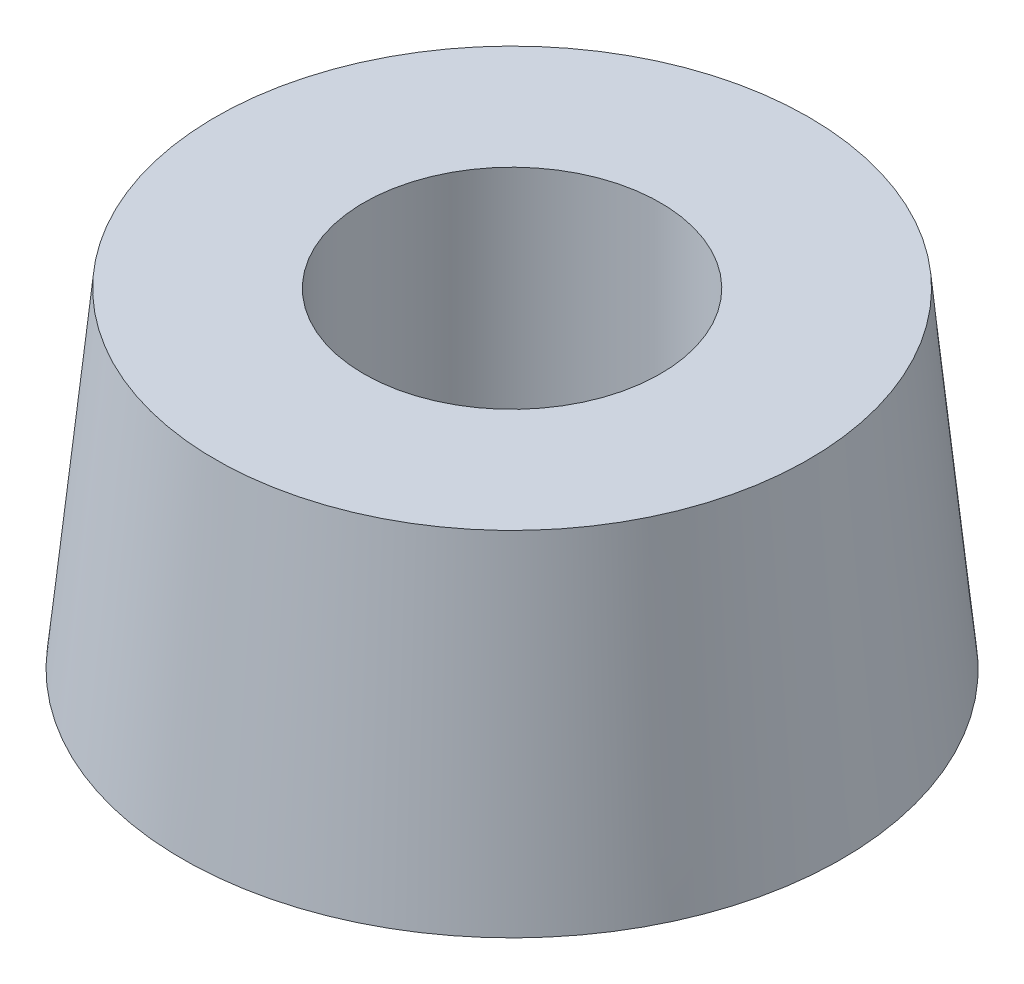
ISO-10303-21;
HEADER;
FILE_DESCRIPTION(('STEP AP214'),'2;1');
FILE_NAME('part.step','',(''),(''),'','','');
FILE_SCHEMA(('AUTOMOTIVE_DESIGN { 1 0 10303 214 1 1 1 1 }'));
ENDSEC;
DATA;
#1=APPLICATION_CONTEXT('core data for automotive mechanical design processes');
#2=APPLICATION_PROTOCOL_DEFINITION('international standard','automotive_design',2000,#1);
#3=PRODUCT_CONTEXT('',#1,'mechanical');
#4=PRODUCT('Part','Part','',(#3));
#5=PRODUCT_RELATED_PRODUCT_CATEGORY('part','',(#4));
#6=PRODUCT_DEFINITION_FORMATION('','',#4);
#7=PRODUCT_DEFINITION_CONTEXT('part definition',#1,'design');
#8=PRODUCT_DEFINITION('design','',#6,#7);
#9=PRODUCT_DEFINITION_SHAPE('','',#8);
#10=(LENGTH_UNIT() NAMED_UNIT(*) SI_UNIT(.MILLI.,.METRE.));
#11=(NAMED_UNIT(*) PLANE_ANGLE_UNIT() SI_UNIT($,.RADIAN.));
#12=(NAMED_UNIT(*) SI_UNIT($,.STERADIAN.) SOLID_ANGLE_UNIT());
#13=UNCERTAINTY_MEASURE_WITH_UNIT(LENGTH_MEASURE(1.E-05),#10,'distance_accuracy_value','');
#14=(GEOMETRIC_REPRESENTATION_CONTEXT(3) GLOBAL_UNCERTAINTY_ASSIGNED_CONTEXT((#13)) GLOBAL_UNIT_ASSIGNED_CONTEXT((#10,
#11,#12)) REPRESENTATION_CONTEXT('',''));
#15=CARTESIAN_POINT('',(0.,0.,0.));
#16=DIRECTION('',(0.,0.,1.));
#17=DIRECTION('',(1.,0.,0.));
#18=AXIS2_PLACEMENT_3D('',#15,#16,#17);
#19=CARTESIAN_POINT('',(0.,10.,0.));
#20=DIRECTION('',(0.,-1.,0.));
#21=DIRECTION('',(0.,0.,-1.));
#22=AXIS2_PLACEMENT_3D('',#19,#20,#21);
#23=PLANE('',#22);
#24=CARTESIAN_POINT('',(0.,10.,0.));
#25=DIRECTION('',(0.,1.,0.));
#26=DIRECTION('',(0.,0.,1.));
#27=AXIS2_PLACEMENT_3D('',#24,#25,#26);
#28=CIRCLE('',#27,4.5);
#29=CARTESIAN_POINT('',(0.,10.,4.5));
#30=VERTEX_POINT('',#29);
#31=EDGE_CURVE('E57',#30,#30,#28,.T.);
#32=ORIENTED_EDGE('',*,*,#31,.F.);
#33=EDGE_LOOP('',(#32));
#34=FACE_BOUND('',#33,.T.);
#35=CARTESIAN_POINT('',(0.,10.,0.));
#36=DIRECTION('',(0.,-1.,0.));
#37=DIRECTION('',(0.,0.,-1.));
#38=AXIS2_PLACEMENT_3D('',#35,#36,#37);
#39=CIRCLE('',#38,9.);
#40=CARTESIAN_POINT('',(0.,10.,-9.));
#41=VERTEX_POINT('',#40);
#42=EDGE_CURVE('E10',#41,#41,#39,.T.);
#43=ORIENTED_EDGE('',*,*,#42,.F.);
#44=EDGE_LOOP('',(#43));
#45=FACE_BOUND('',#44,.T.);
#46=ADVANCED_FACE('F41',(#34,#45),#23,.F.);
#47=CARTESIAN_POINT('',(0.,10.,0.));
#48=DIRECTION('',(0.,-1.,0.));
#49=DIRECTION('',(0.,0.,-1.));
#50=AXIS2_PLACEMENT_3D('',#47,#48,#49);
#51=CONICAL_SURFACE('',#50,9.,0.0996686524911621);
#52=CARTESIAN_POINT('',(0.,0.,0.));
#53=DIRECTION('',(0.,-1.,0.));
#54=DIRECTION('',(0.,0.,-1.));
#55=AXIS2_PLACEMENT_3D('',#52,#53,#54);
#56=CIRCLE('',#55,10.);
#57=CARTESIAN_POINT('',(0.,0.,-10.));
#58=VERTEX_POINT('',#57);
#59=EDGE_CURVE('E49',#58,#58,#56,.T.);
#60=ORIENTED_EDGE('',*,*,#59,.F.);
#61=EDGE_LOOP('',(#60));
#62=FACE_BOUND('',#61,.T.);
#63=ORIENTED_EDGE('',*,*,#42,.T.);
#64=EDGE_LOOP('',(#63));
#65=FACE_BOUND('',#64,.T.);
#66=ADVANCED_FACE('F85',(#62,#65),#51,.T.);
#67=CARTESIAN_POINT('',(0.,0.,10.));
#68=DIRECTION('',(0.,1.,0.));
#69=DIRECTION('',(0.,0.,1.));
#70=AXIS2_PLACEMENT_3D('',#67,#68,#69);
#71=PLANE('',#70);
#72=CARTESIAN_POINT('',(0.,0.,0.));
#73=DIRECTION('',(0.,1.,0.));
#74=DIRECTION('',(0.,0.,1.));
#75=AXIS2_PLACEMENT_3D('',#72,#73,#74);
#76=CIRCLE('',#75,2.5);
#77=CARTESIAN_POINT('',(0.,0.,2.5));
#78=VERTEX_POINT('',#77);
#79=EDGE_CURVE('E64',#78,#78,#76,.F.);
#80=ORIENTED_EDGE('',*,*,#79,.F.);
#81=EDGE_LOOP('',(#80));
#82=FACE_BOUND('',#81,.T.);
#83=ORIENTED_EDGE('',*,*,#59,.T.);
#84=EDGE_LOOP('',(#83));
#85=FACE_BOUND('',#84,.T.);
#86=ADVANCED_FACE('F90',(#82,#85),#71,.F.);
#87=CARTESIAN_POINT('',(0.,3.5,0.));
#88=DIRECTION('',(0.,1.,0.));
#89=DIRECTION('',(0.,0.,1.));
#90=AXIS2_PLACEMENT_3D('',#87,#88,#89);
#91=CYLINDRICAL_SURFACE('',#90,4.5);
#92=CARTESIAN_POINT('',(0.,3.5,0.));
#93=DIRECTION('',(0.,1.,0.));
#94=DIRECTION('',(0.,0.,1.));
#95=AXIS2_PLACEMENT_3D('',#92,#93,#94);
#96=CIRCLE('',#95,4.5);
#97=CARTESIAN_POINT('',(0.,3.5,4.5));
#98=VERTEX_POINT('',#97);
#99=EDGE_CURVE('E54',#98,#98,#96,.T.);
#100=ORIENTED_EDGE('',*,*,#99,.F.);
#101=EDGE_LOOP('',(#100));
#102=FACE_BOUND('',#101,.T.);
#103=ORIENTED_EDGE('',*,*,#31,.T.);
#104=EDGE_LOOP('',(#103));
#105=FACE_BOUND('',#104,.T.);
#106=ADVANCED_FACE('F82',(#102,#105),#91,.F.);
#107=CARTESIAN_POINT('',(0.,3.5,0.));
#108=DIRECTION('',(0.,1.,0.));
#109=DIRECTION('',(0.,0.,1.));
#110=AXIS2_PLACEMENT_3D('',#107,#108,#109);
#111=PLANE('',#110);
#112=CARTESIAN_POINT('',(0.,3.5,0.));
#113=DIRECTION('',(0.,1.,0.));
#114=DIRECTION('',(0.,0.,1.));
#115=AXIS2_PLACEMENT_3D('',#112,#113,#114);
#116=CIRCLE('',#115,2.5);
#117=CARTESIAN_POINT('',(0.,3.5,2.5));
#118=VERTEX_POINT('',#117);
#119=EDGE_CURVE('E44',#118,#118,#116,.F.);
#120=ORIENTED_EDGE('',*,*,#119,.T.);
#121=EDGE_LOOP('',(#120));
#122=FACE_BOUND('',#121,.T.);
#123=ORIENTED_EDGE('',*,*,#99,.T.);
#124=EDGE_LOOP('',(#123));
#125=FACE_BOUND('',#124,.T.);
#126=ADVANCED_FACE('F73',(#122,#125),#111,.T.);
#127=CARTESIAN_POINT('',(0.,10.,0.));
#128=DIRECTION('',(0.,-1.,0.));
#129=DIRECTION('',(0.,0.,-1.));
#130=AXIS2_PLACEMENT_3D('',#127,#128,#129);
#131=CYLINDRICAL_SURFACE('',#130,2.5);
#132=ORIENTED_EDGE('',*,*,#119,.F.);
#133=EDGE_LOOP('',(#132));
#134=FACE_BOUND('',#133,.T.);
#135=ORIENTED_EDGE('',*,*,#79,.T.);
#136=EDGE_LOOP('',(#135));
#137=FACE_BOUND('',#136,.T.);
#138=ADVANCED_FACE('F76',(#134,#137),#131,.F.);
#139=CLOSED_SHELL('',(#46,#66,#86,#106,#126,#138));
#140=MANIFOLD_SOLID_BREP('B2',#139);
#141=ADVANCED_BREP_SHAPE_REPRESENTATION('',(#18,#140),#14);
#142=SHAPE_DEFINITION_REPRESENTATION(#9,#141);
ENDSEC;
END-ISO-10303-21;
